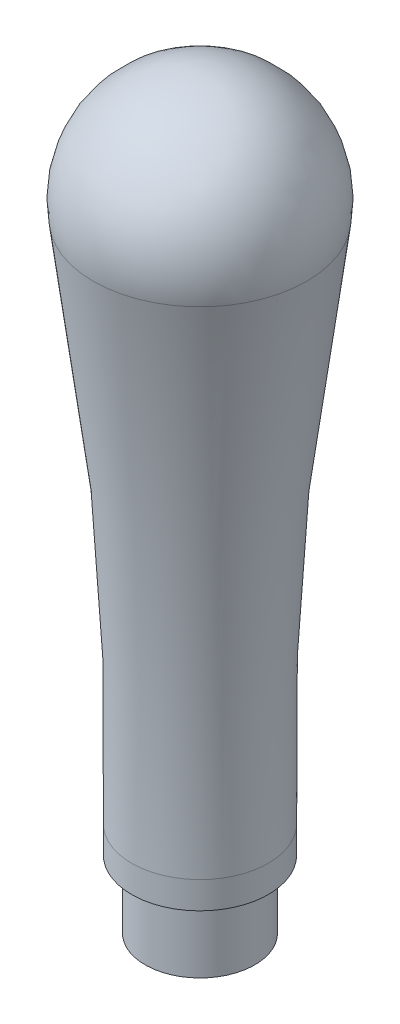
ISO-10303-21;
HEADER;
FILE_DESCRIPTION(('STEP AP214'),'2;1');
FILE_NAME('part.step','',(''),(''),'','','');
FILE_SCHEMA(('AUTOMOTIVE_DESIGN { 1 0 10303 214 1 1 1 1 }'));
ENDSEC;
DATA;
#1=APPLICATION_CONTEXT('core data for automotive mechanical design processes');
#2=APPLICATION_PROTOCOL_DEFINITION('international standard','automotive_design',2000,#1);
#3=PRODUCT_CONTEXT('',#1,'mechanical');
#4=PRODUCT('Part','Part','',(#3));
#5=PRODUCT_RELATED_PRODUCT_CATEGORY('part','',(#4));
#6=PRODUCT_DEFINITION_FORMATION('','',#4);
#7=PRODUCT_DEFINITION_CONTEXT('part definition',#1,'design');
#8=PRODUCT_DEFINITION('design','',#6,#7);
#9=PRODUCT_DEFINITION_SHAPE('','',#8);
#10=(LENGTH_UNIT() NAMED_UNIT(*) SI_UNIT(.MILLI.,.METRE.));
#11=(NAMED_UNIT(*) PLANE_ANGLE_UNIT() SI_UNIT($,.RADIAN.));
#12=(NAMED_UNIT(*) SI_UNIT($,.STERADIAN.) SOLID_ANGLE_UNIT());
#13=UNCERTAINTY_MEASURE_WITH_UNIT(LENGTH_MEASURE(1.E-05),#10,'distance_accuracy_value','');
#14=(GEOMETRIC_REPRESENTATION_CONTEXT(3) GLOBAL_UNCERTAINTY_ASSIGNED_CONTEXT((#13)) GLOBAL_UNIT_ASSIGNED_CONTEXT((#10,
#11,#12)) REPRESENTATION_CONTEXT('',''));
#15=CARTESIAN_POINT('',(0.,0.,0.));
#16=DIRECTION('',(0.,0.,1.));
#17=DIRECTION('',(1.,0.,0.));
#18=AXIS2_PLACEMENT_3D('',#15,#16,#17);
#19=CARTESIAN_POINT('',(0.,47.,0.));
#20=DIRECTION('',(0.,1.,0.));
#21=DIRECTION('',(1.,0.,0.));
#22=AXIS2_PLACEMENT_3D('',#19,#20,#21);
#23=SPHERICAL_SURFACE('',#22,7.99999999999999);
#24=CARTESIAN_POINT('',(0.,45.6446778480745,0.));
#25=DIRECTION('',(0.,1.,0.));
#26=DIRECTION('',(-1.,0.,0.));
#27=AXIS2_PLACEMENT_3D('',#24,#25,#26);
#28=CIRCLE('',#27,7.88435805024732);
#29=CARTESIAN_POINT('',(-7.88435805024732,45.6446778480745,0.));
#30=VERTEX_POINT('',#29);
#31=EDGE_CURVE('E38',#30,#30,#28,.T.);
#32=ORIENTED_EDGE('',*,*,#31,.T.);
#33=EDGE_LOOP('',(#32));
#34=FACE_BOUND('',#33,.T.);
#35=ADVANCED_FACE('F31',(#34),#23,.T.);
#36=CARTESIAN_POINT('',(0.,11.7616240499369,0.));
#37=DIRECTION('',(0.,1.,0.));
#38=DIRECTION('',(-1.,0.,0.));
#39=AXIS2_PLACEMENT_3D('',#36,#37,#38);
#40=TOROIDAL_SURFACE('',#39,204.993309306431,200.);
#41=ORIENTED_EDGE('',*,*,#31,.F.);
#42=EDGE_LOOP('',(#41));
#43=FACE_BOUND('',#42,.T.);
#44=CARTESIAN_POINT('',(0.,7.,0.));
#45=DIRECTION('',(0.,1.,0.));
#46=DIRECTION('',(-1.,0.,0.));
#47=AXIS2_PLACEMENT_3D('',#44,#45,#46);
#48=CIRCLE('',#47,5.05000000000001);
#49=CARTESIAN_POINT('',(-5.05000000000001,7.,0.));
#50=VERTEX_POINT('',#49);
#51=EDGE_CURVE('E42',#50,#50,#48,.T.);
#52=ORIENTED_EDGE('',*,*,#51,.T.);
#53=EDGE_LOOP('',(#52));
#54=FACE_BOUND('',#53,.T.);
#55=ADVANCED_FACE('F68',(#43,#54),#40,.F.);
#56=CARTESIAN_POINT('',(0.,55.,0.));
#57=DIRECTION('',(0.,1.,0.));
#58=DIRECTION('',(-1.,0.,0.));
#59=AXIS2_PLACEMENT_3D('',#56,#57,#58);
#60=CYLINDRICAL_SURFACE('',#59,5.05000000000001);
#61=ORIENTED_EDGE('',*,*,#51,.F.);
#62=EDGE_LOOP('',(#61));
#63=FACE_BOUND('',#62,.T.);
#64=CARTESIAN_POINT('',(0.,5.,0.));
#65=DIRECTION('',(0.,1.,0.));
#66=DIRECTION('',(-1.,0.,0.));
#67=AXIS2_PLACEMENT_3D('',#64,#65,#66);
#68=CIRCLE('',#67,5.05000000000001);
#69=CARTESIAN_POINT('',(-5.05000000000001,5.,0.));
#70=VERTEX_POINT('',#69);
#71=EDGE_CURVE('E46',#70,#70,#68,.T.);
#72=ORIENTED_EDGE('',*,*,#71,.T.);
#73=EDGE_LOOP('',(#72));
#74=FACE_BOUND('',#73,.T.);
#75=ADVANCED_FACE('F65',(#63,#74),#60,.T.);
#76=CARTESIAN_POINT('',(0.,55.,0.));
#77=DIRECTION('',(0.,1.,0.));
#78=DIRECTION('',(-1.,0.,0.));
#79=AXIS2_PLACEMENT_3D('',#76,#77,#78);
#80=CYLINDRICAL_SURFACE('',#79,4.05000000000001);
#81=CARTESIAN_POINT('',(0.,4.42264973081036,0.));
#82=DIRECTION('',(0.,1.,0.));
#83=DIRECTION('',(-1.,0.,0.));
#84=AXIS2_PLACEMENT_3D('',#81,#82,#83);
#85=CIRCLE('',#84,4.05000000000001);
#86=CARTESIAN_POINT('',(-4.05000000000001,4.42264973081036,0.));
#87=VERTEX_POINT('',#86);
#88=EDGE_CURVE('E10',#87,#87,#85,.F.);
#89=ORIENTED_EDGE('',*,*,#88,.T.);
#90=EDGE_LOOP('',(#89));
#91=FACE_BOUND('',#90,.T.);
#92=CARTESIAN_POINT('',(0.,0.,0.));
#93=DIRECTION('',(0.,1.,0.));
#94=DIRECTION('',(-1.,0.,0.));
#95=AXIS2_PLACEMENT_3D('',#92,#93,#94);
#96=CIRCLE('',#95,4.05000000000001);
#97=CARTESIAN_POINT('',(-4.05000000000001,0.,0.));
#98=VERTEX_POINT('',#97);
#99=EDGE_CURVE('E51',#98,#98,#96,.T.);
#100=ORIENTED_EDGE('',*,*,#99,.T.);
#101=EDGE_LOOP('',(#100));
#102=FACE_BOUND('',#101,.T.);
#103=ADVANCED_FACE('F55',(#91,#102),#80,.T.);
#104=CARTESIAN_POINT('',(0.,0.,0.));
#105=DIRECTION('',(0.,1.,0.));
#106=DIRECTION('',(-1.,0.,0.));
#107=AXIS2_PLACEMENT_3D('',#104,#105,#106);
#108=PLANE('',#107);
#109=ORIENTED_EDGE('',*,*,#99,.F.);
#110=EDGE_LOOP('',(#109));
#111=FACE_BOUND('',#110,.T.);
#112=ADVANCED_FACE('F57',(#111),#108,.F.);
#113=CARTESIAN_POINT('',(0.,5.,0.));
#114=DIRECTION('',(0.,1.,0.));
#115=DIRECTION('',(-1.,0.,0.));
#116=AXIS2_PLACEMENT_3D('',#113,#114,#115);
#117=CONICAL_SURFACE('',#116,5.05000000000001,1.04719755119659);
#118=ORIENTED_EDGE('',*,*,#88,.F.);
#119=EDGE_LOOP('',(#118));
#120=FACE_BOUND('',#119,.T.);
#121=ORIENTED_EDGE('',*,*,#71,.F.);
#122=EDGE_LOOP('',(#121));
#123=FACE_BOUND('',#122,.T.);
#124=ADVANCED_FACE('F33',(#120,#123),#117,.T.);
#125=CLOSED_SHELL('',(#35,#55,#75,#103,#112,#124));
#126=MANIFOLD_SOLID_BREP('B2',#125);
#127=ADVANCED_BREP_SHAPE_REPRESENTATION('',(#18,#126),#14);
#128=SHAPE_DEFINITION_REPRESENTATION(#9,#127);
ENDSEC;
END-ISO-10303-21;
